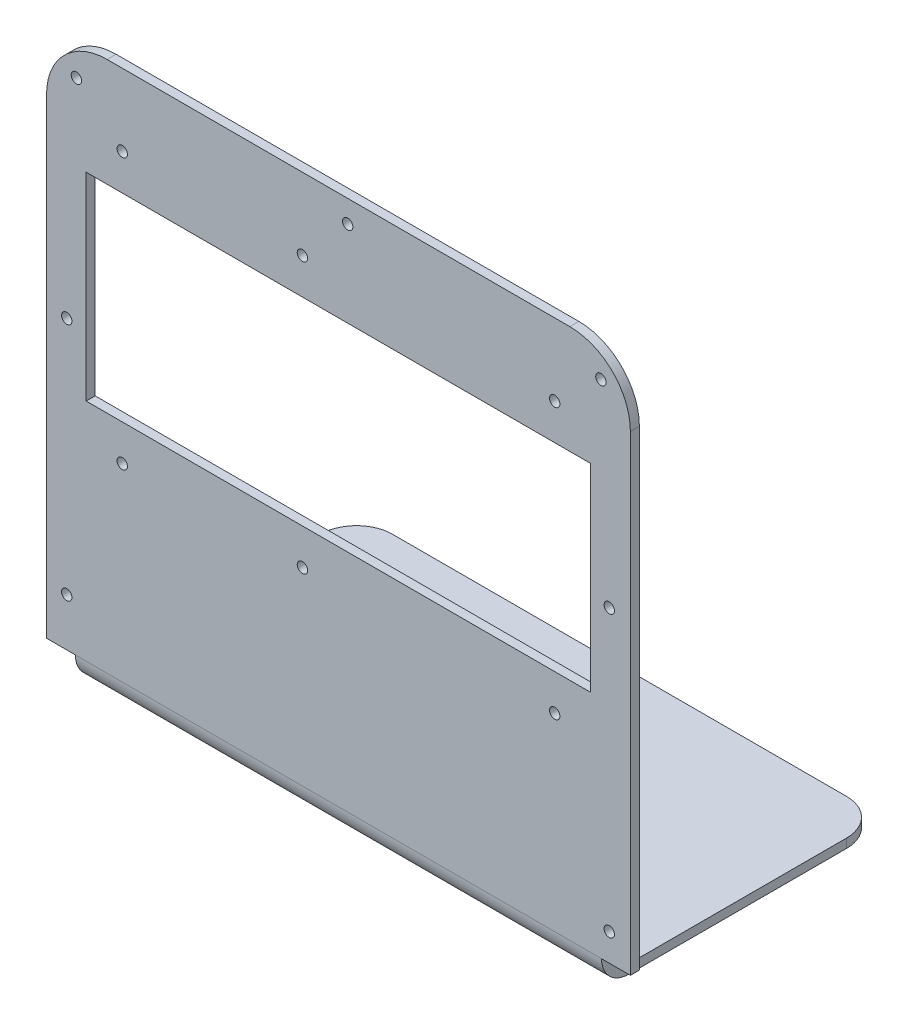
ISO-10303-21;
HEADER;
FILE_DESCRIPTION(('STEP AP214'),'2;1');
FILE_NAME('part.step','',(''),(''),'','','');
FILE_SCHEMA(('AUTOMOTIVE_DESIGN { 1 0 10303 214 1 1 1 1 }'));
ENDSEC;
DATA;
#1=APPLICATION_CONTEXT('core data for automotive mechanical design processes');
#2=APPLICATION_PROTOCOL_DEFINITION('international standard','automotive_design',2000,#1);
#3=PRODUCT_CONTEXT('',#1,'mechanical');
#4=PRODUCT('Part','Part','',(#3));
#5=PRODUCT_RELATED_PRODUCT_CATEGORY('part','',(#4));
#6=PRODUCT_DEFINITION_FORMATION('','',#4);
#7=PRODUCT_DEFINITION_CONTEXT('part definition',#1,'design');
#8=PRODUCT_DEFINITION('design','',#6,#7);
#9=PRODUCT_DEFINITION_SHAPE('','',#8);
#10=(LENGTH_UNIT() NAMED_UNIT(*) SI_UNIT(.MILLI.,.METRE.));
#11=(NAMED_UNIT(*) PLANE_ANGLE_UNIT() SI_UNIT($,.RADIAN.));
#12=(NAMED_UNIT(*) SI_UNIT($,.STERADIAN.) SOLID_ANGLE_UNIT());
#13=UNCERTAINTY_MEASURE_WITH_UNIT(LENGTH_MEASURE(1.E-05),#10,'distance_accuracy_value','');
#14=(GEOMETRIC_REPRESENTATION_CONTEXT(3) GLOBAL_UNCERTAINTY_ASSIGNED_CONTEXT((#13)) GLOBAL_UNIT_ASSIGNED_CONTEXT((#10,
#11,#12)) REPRESENTATION_CONTEXT('',''));
#15=CARTESIAN_POINT('',(0.,0.,0.));
#16=DIRECTION('',(0.,0.,1.));
#17=DIRECTION('',(1.,0.,0.));
#18=AXIS2_PLACEMENT_3D('',#15,#16,#17);
#19=CARTESIAN_POINT('',(-92.71,0.,0.));
#20=DIRECTION('',(1.,0.,0.));
#21=DIRECTION('',(0.,0.,1.));
#22=AXIS2_PLACEMENT_3D('',#19,#20,#21);
#23=PLANE('',#22);
#24=DIRECTION('',(0.,0.,-1.));
#25=VECTOR('',#24,1.);
#26=CARTESIAN_POINT('',(-92.71,-22.225,25.4));
#27=LINE('',#26,#25);
#28=CARTESIAN_POINT('',(-92.71,-22.225,15.875));
#29=VERTEX_POINT('',#28);
#30=CARTESIAN_POINT('',(-92.71,-22.225,-60.96));
#31=VERTEX_POINT('',#30);
#32=EDGE_CURVE('E220',#29,#31,#27,.T.);
#33=ORIENTED_EDGE('',*,*,#32,.T.);
#34=DIRECTION('',(0.,1.,0.));
#35=VECTOR('',#34,1.);
#36=CARTESIAN_POINT('',(-92.71,-25.4,-60.96));
#37=LINE('',#36,#35);
#38=CARTESIAN_POINT('',(-92.71,-25.4,-60.96));
#39=VERTEX_POINT('',#38);
#40=EDGE_CURVE('E309',#31,#39,#37,.F.);
#41=ORIENTED_EDGE('',*,*,#40,.T.);
#42=DIRECTION('',(0.,0.,-1.));
#43=VECTOR('',#42,1.);
#44=CARTESIAN_POINT('',(-92.71,-25.4,25.4));
#45=LINE('',#44,#43);
#46=CARTESIAN_POINT('',(-92.71,-25.4,15.875));
#47=VERTEX_POINT('',#46);
#48=EDGE_CURVE('E208',#47,#39,#45,.T.);
#49=ORIENTED_EDGE('',*,*,#48,.F.);
#50=DIRECTION('',(0.,1.,0.));
#51=VECTOR('',#50,1.);
#52=CARTESIAN_POINT('',(-92.71,-25.4,15.875));
#53=LINE('',#52,#51);
#54=EDGE_CURVE('E280',#47,#29,#53,.T.);
#55=ORIENTED_EDGE('',*,*,#54,.T.);
#56=EDGE_LOOP('',(#33,#41,#49,#55));
#57=FACE_BOUND('',#56,.T.);
#58=ADVANCED_FACE('F45',(#57),#23,.F.);
#59=CARTESIAN_POINT('',(92.71,0.,0.));
#60=DIRECTION('',(-1.,0.,0.));
#61=DIRECTION('',(0.,0.,1.));
#62=AXIS2_PLACEMENT_3D('',#59,#60,#61);
#63=PLANE('',#62);
#64=DIRECTION('',(0.,0.,-1.));
#65=VECTOR('',#64,1.);
#66=CARTESIAN_POINT('',(92.71,-25.4,25.4));
#67=LINE('',#66,#65);
#68=CARTESIAN_POINT('',(92.71,-25.4,15.875));
#69=VERTEX_POINT('',#68);
#70=CARTESIAN_POINT('',(92.71,-25.4,-60.96));
#71=VERTEX_POINT('',#70);
#72=EDGE_CURVE('E226',#69,#71,#67,.T.);
#73=ORIENTED_EDGE('',*,*,#72,.T.);
#74=DIRECTION('',(0.,1.,0.));
#75=VECTOR('',#74,1.);
#76=CARTESIAN_POINT('',(92.71,-22.225,-60.96));
#77=LINE('',#76,#75);
#78=CARTESIAN_POINT('',(92.71,-22.225,-60.96));
#79=VERTEX_POINT('',#78);
#80=EDGE_CURVE('E12',#71,#79,#77,.T.);
#81=ORIENTED_EDGE('',*,*,#80,.T.);
#82=DIRECTION('',(0.,0.,1.));
#83=VECTOR('',#82,1.);
#84=CARTESIAN_POINT('',(92.71,-22.225,25.4));
#85=LINE('',#84,#83);
#86=CARTESIAN_POINT('',(92.71,-22.225,15.875));
#87=VERTEX_POINT('',#86);
#88=EDGE_CURVE('E231',#79,#87,#85,.T.);
#89=ORIENTED_EDGE('',*,*,#88,.T.);
#90=DIRECTION('',(0.,-1.,0.));
#91=VECTOR('',#90,1.);
#92=CARTESIAN_POINT('',(92.71,-22.225,15.875));
#93=LINE('',#92,#91);
#94=EDGE_CURVE('E275',#87,#69,#93,.T.);
#95=ORIENTED_EDGE('',*,*,#94,.T.);
#96=EDGE_LOOP('',(#73,#81,#89,#95));
#97=FACE_BOUND('',#96,.T.);
#98=ADVANCED_FACE('F387',(#97),#63,.F.);
#99=CARTESIAN_POINT('',(102.87,-22.225,15.875));
#100=DIRECTION('',(1.,0.,0.));
#101=DIRECTION('',(0.,0.,-1.));
#102=AXIS2_PLACEMENT_3D('',#99,#100,#101);
#103=PLANE('',#102);
#104=DIRECTION('',(0.,1.,0.));
#105=VECTOR('',#104,1.);
#106=CARTESIAN_POINT('',(102.87,-25.4,22.225));
#107=LINE('',#106,#105);
#108=CARTESIAN_POINT('',(102.87,150.114,22.225));
#109=VERTEX_POINT('',#108);
#110=CARTESIAN_POINT('',(102.87,-15.875,22.225));
#111=VERTEX_POINT('',#110);
#112=EDGE_CURVE('E234',#109,#111,#107,.F.);
#113=ORIENTED_EDGE('',*,*,#112,.F.);
#114=DIRECTION('',(0.,0.,-1.));
#115=VECTOR('',#114,1.);
#116=CARTESIAN_POINT('',(102.87,150.114,15.875));
#117=LINE('',#116,#115);
#118=CARTESIAN_POINT('',(102.87,150.114,25.4));
#119=VERTEX_POINT('',#118);
#120=EDGE_CURVE('E298',#109,#119,#117,.F.);
#121=ORIENTED_EDGE('',*,*,#120,.T.);
#122=DIRECTION('',(0.,-1.,0.));
#123=VECTOR('',#122,1.);
#124=CARTESIAN_POINT('',(102.87,-25.4,25.4));
#125=LINE('',#124,#123);
#126=CARTESIAN_POINT('',(102.87,-15.875,25.4));
#127=VERTEX_POINT('',#126);
#128=EDGE_CURVE('E236',#119,#127,#125,.T.);
#129=ORIENTED_EDGE('',*,*,#128,.T.);
#130=DIRECTION('',(0.,0.,-1.));
#131=VECTOR('',#130,1.);
#132=CARTESIAN_POINT('',(102.87,-15.875,25.4));
#133=LINE('',#132,#131);
#134=EDGE_CURVE('E269',#127,#111,#133,.T.);
#135=ORIENTED_EDGE('',*,*,#134,.T.);
#136=EDGE_LOOP('',(#113,#121,#129,#135));
#137=FACE_BOUND('',#136,.T.);
#138=ADVANCED_FACE('F351',(#137),#103,.T.);
#139=CARTESIAN_POINT('',(102.87,-25.4,25.4));
#140=DIRECTION('',(0.,1.,0.));
#141=DIRECTION('',(0.,0.,1.));
#142=AXIS2_PLACEMENT_3D('',#139,#140,#141);
#143=PLANE('',#142);
#144=ORIENTED_EDGE('',*,*,#48,.T.);
#145=CARTESIAN_POINT('',(-80.01,-25.4,-60.96));
#146=DIRECTION('',(0.,1.,0.));
#147=DIRECTION('',(0.,0.,1.));
#148=AXIS2_PLACEMENT_3D('',#145,#146,#147);
#149=CIRCLE('',#148,12.7);
#150=CARTESIAN_POINT('',(-80.01,-25.4,-73.66));
#151=VERTEX_POINT('',#150);
#152=EDGE_CURVE('E53',#39,#151,#149,.F.);
#153=ORIENTED_EDGE('',*,*,#152,.T.);
#154=DIRECTION('',(-1.,0.,0.));
#155=VECTOR('',#154,1.);
#156=CARTESIAN_POINT('',(102.87,-25.4,-73.66));
#157=LINE('',#156,#155);
#158=CARTESIAN_POINT('',(80.01,-25.4,-73.66));
#159=VERTEX_POINT('',#158);
#160=EDGE_CURVE('E263',#159,#151,#157,.T.);
#161=ORIENTED_EDGE('',*,*,#160,.F.);
#162=CARTESIAN_POINT('',(80.01,-25.4,-60.96));
#163=DIRECTION('',(0.,1.,0.));
#164=DIRECTION('',(0.,0.,1.));
#165=AXIS2_PLACEMENT_3D('',#162,#163,#164);
#166=CIRCLE('',#165,12.7);
#167=EDGE_CURVE('E311',#159,#71,#166,.F.);
#168=ORIENTED_EDGE('',*,*,#167,.T.);
#169=ORIENTED_EDGE('',*,*,#72,.F.);
#170=DIRECTION('',(-1.,0.,0.));
#171=VECTOR('',#170,1.);
#172=CARTESIAN_POINT('',(102.87,-25.4,15.875));
#173=LINE('',#172,#171);
#174=EDGE_CURVE('E239',#69,#47,#173,.T.);
#175=ORIENTED_EDGE('',*,*,#174,.T.);
#176=EDGE_LOOP('',(#144,#153,#161,#168,#169,#175));
#177=FACE_BOUND('',#176,.T.);
#178=ADVANCED_FACE('F315',(#177),#143,.F.);
#179=CARTESIAN_POINT('',(102.87,-22.225,-73.66));
#180=DIRECTION('',(0.,0.,-1.));
#181=DIRECTION('',(-1.,0.,0.));
#182=AXIS2_PLACEMENT_3D('',#179,#180,#181);
#183=PLANE('',#182);
#184=ORIENTED_EDGE('',*,*,#160,.T.);
#185=DIRECTION('',(0.,1.,0.));
#186=VECTOR('',#185,1.);
#187=CARTESIAN_POINT('',(-80.01,-22.225,-73.66));
#188=LINE('',#187,#186);
#189=CARTESIAN_POINT('',(-80.01,-22.225,-73.66));
#190=VERTEX_POINT('',#189);
#191=EDGE_CURVE('E302',#151,#190,#188,.T.);
#192=ORIENTED_EDGE('',*,*,#191,.T.);
#193=DIRECTION('',(-1.,0.,0.));
#194=VECTOR('',#193,1.);
#195=CARTESIAN_POINT('',(102.87,-22.225,-73.66));
#196=LINE('',#195,#194);
#197=CARTESIAN_POINT('',(80.01,-22.225,-73.66));
#198=VERTEX_POINT('',#197);
#199=EDGE_CURVE('E260',#198,#190,#196,.T.);
#200=ORIENTED_EDGE('',*,*,#199,.F.);
#201=DIRECTION('',(0.,1.,0.));
#202=VECTOR('',#201,1.);
#203=CARTESIAN_POINT('',(80.01,-25.4,-73.66));
#204=LINE('',#203,#202);
#205=EDGE_CURVE('E300',#198,#159,#204,.F.);
#206=ORIENTED_EDGE('',*,*,#205,.T.);
#207=EDGE_LOOP('',(#184,#192,#200,#206));
#208=FACE_BOUND('',#207,.T.);
#209=ADVANCED_FACE('F322',(#208),#183,.T.);
#210=CARTESIAN_POINT('',(102.87,-22.225,25.4));
#211=DIRECTION('',(0.,1.,0.));
#212=DIRECTION('',(0.,0.,1.));
#213=AXIS2_PLACEMENT_3D('',#210,#211,#212);
#214=PLANE('',#213);
#215=ORIENTED_EDGE('',*,*,#199,.T.);
#216=CARTESIAN_POINT('',(-80.01,-22.225,-60.96));
#217=DIRECTION('',(0.,1.,0.));
#218=DIRECTION('',(0.,0.,1.));
#219=AXIS2_PLACEMENT_3D('',#216,#217,#218);
#220=CIRCLE('',#219,12.7);
#221=EDGE_CURVE('E307',#190,#31,#220,.T.);
#222=ORIENTED_EDGE('',*,*,#221,.T.);
#223=ORIENTED_EDGE('',*,*,#32,.F.);
#224=DIRECTION('',(-1.,0.,0.));
#225=VECTOR('',#224,1.);
#226=CARTESIAN_POINT('',(102.87,-22.225,15.875));
#227=LINE('',#226,#225);
#228=EDGE_CURVE('E257',#87,#29,#227,.T.);
#229=ORIENTED_EDGE('',*,*,#228,.F.);
#230=ORIENTED_EDGE('',*,*,#88,.F.);
#231=CARTESIAN_POINT('',(80.01,-22.225,-60.96));
#232=DIRECTION('',(0.,1.,0.));
#233=DIRECTION('',(0.,0.,1.));
#234=AXIS2_PLACEMENT_3D('',#231,#232,#233);
#235=CIRCLE('',#234,12.7);
#236=EDGE_CURVE('E305',#79,#198,#235,.T.);
#237=ORIENTED_EDGE('',*,*,#236,.T.);
#238=EDGE_LOOP('',(#215,#222,#223,#229,#230,#237));
#239=FACE_BOUND('',#238,.T.);
#240=ADVANCED_FACE('F328',(#239),#214,.T.);
#241=CARTESIAN_POINT('',(102.87,-15.875,15.875));
#242=DIRECTION('',(-1.,0.,0.));
#243=DIRECTION('',(0.,0.,1.));
#244=AXIS2_PLACEMENT_3D('',#241,#242,#243);
#245=CYLINDRICAL_SURFACE('',#244,6.35);
#246=CARTESIAN_POINT('',(-92.71,-15.875,15.875));
#247=DIRECTION('',(1.,0.,0.));
#248=DIRECTION('',(0.,0.,-1.));
#249=AXIS2_PLACEMENT_3D('',#246,#247,#248);
#250=CIRCLE('',#249,6.35);
#251=CARTESIAN_POINT('',(-92.71,-15.875,22.225));
#252=VERTEX_POINT('',#251);
#253=EDGE_CURVE('E217',#252,#29,#250,.T.);
#254=ORIENTED_EDGE('',*,*,#253,.F.);
#255=DIRECTION('',(-1.,0.,0.));
#256=VECTOR('',#255,1.);
#257=CARTESIAN_POINT('',(102.87,-15.875,22.225));
#258=LINE('',#257,#256);
#259=CARTESIAN_POINT('',(92.71,-15.875,22.225));
#260=VERTEX_POINT('',#259);
#261=EDGE_CURVE('E253',#260,#252,#258,.T.);
#262=ORIENTED_EDGE('',*,*,#261,.F.);
#263=CARTESIAN_POINT('',(92.71,-15.875,15.875));
#264=DIRECTION('',(-1.,0.,0.));
#265=DIRECTION('',(0.,0.,1.));
#266=AXIS2_PLACEMENT_3D('',#263,#264,#265);
#267=CIRCLE('',#266,6.35);
#268=EDGE_CURVE('E229',#87,#260,#267,.T.);
#269=ORIENTED_EDGE('',*,*,#268,.F.);
#270=ORIENTED_EDGE('',*,*,#228,.T.);
#271=EDGE_LOOP('',(#254,#262,#269,#270));
#272=FACE_BOUND('',#271,.T.);
#273=ADVANCED_FACE('F338',(#272),#245,.F.);
#274=CARTESIAN_POINT('',(102.87,-25.4,22.225));
#275=DIRECTION('',(0.,0.,-1.));
#276=DIRECTION('',(-1.,0.,0.));
#277=AXIS2_PLACEMENT_3D('',#274,#275,#276);
#278=PLANE('',#277);
#279=CARTESIAN_POINT('',(92.4814,160.8074,22.225));
#280=DIRECTION('',(0.,0.,-1.));
#281=DIRECTION('',(-1.,0.,0.));
#282=AXIS2_PLACEMENT_3D('',#279,#280,#281);
#283=CIRCLE('',#282,1.82879999999999);
#284=CARTESIAN_POINT('',(90.6526,160.8074,22.225));
#285=VERTEX_POINT('',#284);
#286=EDGE_CURVE('E462',#285,#285,#283,.T.);
#287=ORIENTED_EDGE('',*,*,#286,.F.);
#288=EDGE_LOOP('',(#287));
#289=FACE_BOUND('',#288,.T.);
#290=CARTESIAN_POINT('',(95.4278,92.583,22.225));
#291=DIRECTION('',(0.,0.,-1.));
#292=DIRECTION('',(-1.,0.,0.));
#293=AXIS2_PLACEMENT_3D('',#290,#291,#292);
#294=CIRCLE('',#293,1.82879999999999);
#295=CARTESIAN_POINT('',(93.599,92.583,22.225));
#296=VERTEX_POINT('',#295);
#297=EDGE_CURVE('E473',#296,#296,#294,.T.);
#298=ORIENTED_EDGE('',*,*,#297,.F.);
#299=EDGE_LOOP('',(#298));
#300=FACE_BOUND('',#299,.T.);
#301=CARTESIAN_POINT('',(95.4278,-6.22300000000001,22.225));
#302=DIRECTION('',(0.,0.,-1.));
#303=DIRECTION('',(-1.,0.,0.));
#304=AXIS2_PLACEMENT_3D('',#301,#302,#303);
#305=CIRCLE('',#304,1.82879999999999);
#306=CARTESIAN_POINT('',(93.599,-6.22300000000001,22.225));
#307=VERTEX_POINT('',#306);
#308=EDGE_CURVE('E479',#307,#307,#305,.T.);
#309=ORIENTED_EDGE('',*,*,#308,.F.);
#310=EDGE_LOOP('',(#309));
#311=FACE_BOUND('',#310,.T.);
#312=CARTESIAN_POINT('',(-95.758,1.01599999999999,22.225));
#313=DIRECTION('',(0.,0.,-1.));
#314=DIRECTION('',(-1.,0.,0.));
#315=AXIS2_PLACEMENT_3D('',#312,#313,#314);
#316=CIRCLE('',#315,1.82879999999999);
#317=CARTESIAN_POINT('',(-97.5868,1.01599999999999,22.225));
#318=VERTEX_POINT('',#317);
#319=EDGE_CURVE('E485',#318,#318,#316,.T.);
#320=ORIENTED_EDGE('',*,*,#319,.F.);
#321=EDGE_LOOP('',(#320));
#322=FACE_BOUND('',#321,.T.);
#323=CARTESIAN_POINT('',(-95.758,85.344,22.225));
#324=DIRECTION('',(0.,0.,-1.));
#325=DIRECTION('',(-1.,0.,0.));
#326=AXIS2_PLACEMENT_3D('',#323,#324,#325);
#327=CIRCLE('',#326,1.82879999999999);
#328=CARTESIAN_POINT('',(-97.5868,85.344,22.225));
#329=VERTEX_POINT('',#328);
#330=EDGE_CURVE('E491',#329,#329,#327,.T.);
#331=ORIENTED_EDGE('',*,*,#330,.F.);
#332=EDGE_LOOP('',(#331));
#333=FACE_BOUND('',#332,.T.);
#334=CARTESIAN_POINT('',(-92.3544,160.401,22.225));
#335=DIRECTION('',(0.,0.,-1.));
#336=DIRECTION('',(-1.,0.,0.));
#337=AXIS2_PLACEMENT_3D('',#334,#335,#336);
#338=CIRCLE('',#337,1.82879999999999);
#339=CARTESIAN_POINT('',(-94.1832,160.401,22.225));
#340=VERTEX_POINT('',#339);
#341=EDGE_CURVE('E497',#340,#340,#338,.T.);
#342=ORIENTED_EDGE('',*,*,#341,.F.);
#343=EDGE_LOOP('',(#342));
#344=FACE_BOUND('',#343,.T.);
#345=CARTESIAN_POINT('',(3.25120000000001,163.6268,22.225));
#346=DIRECTION('',(0.,0.,-1.));
#347=DIRECTION('',(-1.,0.,0.));
#348=AXIS2_PLACEMENT_3D('',#345,#346,#347);
#349=CIRCLE('',#348,1.82879999999999);
#350=CARTESIAN_POINT('',(1.42240000000002,163.6268,22.225));
#351=VERTEX_POINT('',#350);
#352=EDGE_CURVE('E503',#351,#351,#349,.T.);
#353=ORIENTED_EDGE('',*,*,#352,.F.);
#354=EDGE_LOOP('',(#353));
#355=FACE_BOUND('',#354,.T.);
#356=CARTESIAN_POINT('',(-76.2,146.05,22.225));
#357=DIRECTION('',(0.,0.,-1.));
#358=DIRECTION('',(-1.,0.,0.));
#359=AXIS2_PLACEMENT_3D('',#356,#357,#358);
#360=CIRCLE('',#359,1.82879999999998);
#361=CARTESIAN_POINT('',(-78.0288,146.05,22.225));
#362=VERTEX_POINT('',#361);
#363=EDGE_CURVE('E509',#362,#362,#360,.T.);
#364=ORIENTED_EDGE('',*,*,#363,.F.);
#365=EDGE_LOOP('',(#364));
#366=FACE_BOUND('',#365,.T.);
#367=CARTESIAN_POINT('',(-12.7,146.05,22.225));
#368=DIRECTION('',(0.,0.,-1.));
#369=DIRECTION('',(-1.,0.,0.));
#370=AXIS2_PLACEMENT_3D('',#367,#368,#369);
#371=CIRCLE('',#370,1.82879999999998);
#372=CARTESIAN_POINT('',(-14.5288,146.05,22.225));
#373=VERTEX_POINT('',#372);
#374=EDGE_CURVE('E515',#373,#373,#371,.T.);
#375=ORIENTED_EDGE('',*,*,#374,.F.);
#376=EDGE_LOOP('',(#375));
#377=FACE_BOUND('',#376,.T.);
#378=CARTESIAN_POINT('',(76.2,146.05,22.225));
#379=DIRECTION('',(0.,0.,-1.));
#380=DIRECTION('',(-1.,0.,0.));
#381=AXIS2_PLACEMENT_3D('',#378,#379,#380);
#382=CIRCLE('',#381,1.82879999999998);
#383=CARTESIAN_POINT('',(74.3712,146.05,22.225));
#384=VERTEX_POINT('',#383);
#385=EDGE_CURVE('E521',#384,#384,#382,.T.);
#386=ORIENTED_EDGE('',*,*,#385,.F.);
#387=EDGE_LOOP('',(#386));
#388=FACE_BOUND('',#387,.T.);
#389=CARTESIAN_POINT('',(76.2,50.8,22.225));
#390=DIRECTION('',(0.,0.,-1.));
#391=DIRECTION('',(-1.,0.,0.));
#392=AXIS2_PLACEMENT_3D('',#389,#390,#391);
#393=CIRCLE('',#392,1.82879999999998);
#394=CARTESIAN_POINT('',(74.3712,50.8,22.225));
#395=VERTEX_POINT('',#394);
#396=EDGE_CURVE('E527',#395,#395,#393,.T.);
#397=ORIENTED_EDGE('',*,*,#396,.F.);
#398=EDGE_LOOP('',(#397));
#399=FACE_BOUND('',#398,.T.);
#400=CARTESIAN_POINT('',(-12.7,50.8,22.225));
#401=DIRECTION('',(0.,0.,-1.));
#402=DIRECTION('',(-1.,0.,0.));
#403=AXIS2_PLACEMENT_3D('',#400,#401,#402);
#404=CIRCLE('',#403,1.82879999999998);
#405=CARTESIAN_POINT('',(-14.5288,50.8,22.225));
#406=VERTEX_POINT('',#405);
#407=EDGE_CURVE('E533',#406,#406,#404,.T.);
#408=ORIENTED_EDGE('',*,*,#407,.F.);
#409=EDGE_LOOP('',(#408));
#410=FACE_BOUND('',#409,.T.);
#411=CARTESIAN_POINT('',(-76.2,50.8,22.225));
#412=DIRECTION('',(0.,0.,-1.));
#413=DIRECTION('',(-1.,0.,0.));
#414=AXIS2_PLACEMENT_3D('',#411,#412,#413);
#415=CIRCLE('',#414,1.82879999999998);
#416=CARTESIAN_POINT('',(-78.0288,50.8,22.225));
#417=VERTEX_POINT('',#416);
#418=EDGE_CURVE('E539',#417,#417,#415,.T.);
#419=ORIENTED_EDGE('',*,*,#418,.F.);
#420=EDGE_LOOP('',(#419));
#421=FACE_BOUND('',#420,.T.);
#422=DIRECTION('',(0.,-1.,0.));
#423=VECTOR('',#422,1.);
#424=CARTESIAN_POINT('',(88.9,-25.4,22.225));
#425=LINE('',#424,#423);
#426=CARTESIAN_POINT('',(88.9,133.35,22.225));
#427=VERTEX_POINT('',#426);
#428=CARTESIAN_POINT('',(88.9,63.5,22.225));
#429=VERTEX_POINT('',#428);
#430=EDGE_CURVE('E203',#427,#429,#425,.T.);
#431=ORIENTED_EDGE('',*,*,#430,.F.);
#432=DIRECTION('',(1.,0.,0.));
#433=VECTOR('',#432,1.);
#434=CARTESIAN_POINT('',(102.87,133.35,22.225));
#435=LINE('',#434,#433);
#436=CARTESIAN_POINT('',(-88.9,133.35,22.225));
#437=VERTEX_POINT('',#436);
#438=EDGE_CURVE('E196',#437,#427,#435,.T.);
#439=ORIENTED_EDGE('',*,*,#438,.F.);
#440=DIRECTION('',(0.,1.,0.));
#441=VECTOR('',#440,1.);
#442=CARTESIAN_POINT('',(-88.9,-25.4,22.225));
#443=LINE('',#442,#441);
#444=CARTESIAN_POINT('',(-88.9,63.5,22.225));
#445=VERTEX_POINT('',#444);
#446=EDGE_CURVE('E176',#445,#437,#443,.T.);
#447=ORIENTED_EDGE('',*,*,#446,.F.);
#448=DIRECTION('',(-1.,0.,0.));
#449=VECTOR('',#448,1.);
#450=CARTESIAN_POINT('',(102.87,63.5,22.225));
#451=LINE('',#450,#449);
#452=EDGE_CURVE('E201',#429,#445,#451,.T.);
#453=ORIENTED_EDGE('',*,*,#452,.F.);
#454=EDGE_LOOP('',(#431,#439,#447,#453));
#455=FACE_BOUND('',#454,.T.);
#456=DIRECTION('',(0.,1.,0.));
#457=VECTOR('',#456,1.);
#458=CARTESIAN_POINT('',(-102.87,-25.4,22.225));
#459=LINE('',#458,#457);
#460=CARTESIAN_POINT('',(-102.87,150.114,22.225));
#461=VERTEX_POINT('',#460);
#462=CARTESIAN_POINT('',(-102.87,-15.875,22.225));
#463=VERTEX_POINT('',#462);
#464=EDGE_CURVE('E233',#461,#463,#459,.F.);
#465=ORIENTED_EDGE('',*,*,#464,.F.);
#466=CARTESIAN_POINT('',(-81.534,150.114,22.225));
#467=DIRECTION('',(0.,0.,-1.));
#468=DIRECTION('',(-1.,0.,0.));
#469=AXIS2_PLACEMENT_3D('',#466,#467,#468);
#470=CIRCLE('',#469,21.336);
#471=CARTESIAN_POINT('',(-81.534,171.45,22.225));
#472=VERTEX_POINT('',#471);
#473=EDGE_CURVE('E287',#461,#472,#470,.T.);
#474=ORIENTED_EDGE('',*,*,#473,.T.);
#475=DIRECTION('',(-1.,0.,0.));
#476=VECTOR('',#475,1.);
#477=CARTESIAN_POINT('',(102.87,171.45,22.225));
#478=LINE('',#477,#476);
#479=CARTESIAN_POINT('',(81.534,171.45,22.225));
#480=VERTEX_POINT('',#479);
#481=EDGE_CURVE('E250',#480,#472,#478,.T.);
#482=ORIENTED_EDGE('',*,*,#481,.F.);
#483=CARTESIAN_POINT('',(81.534,150.114,22.225));
#484=DIRECTION('',(0.,0.,-1.));
#485=DIRECTION('',(-1.,0.,0.));
#486=AXIS2_PLACEMENT_3D('',#483,#484,#485);
#487=CIRCLE('',#486,21.336);
#488=EDGE_CURVE('E285',#480,#109,#487,.T.);
#489=ORIENTED_EDGE('',*,*,#488,.T.);
#490=ORIENTED_EDGE('',*,*,#112,.T.);
#491=EDGE_CURVE('E254',#111,#260,#258,.T.);
#492=ORIENTED_EDGE('',*,*,#491,.T.);
#493=ORIENTED_EDGE('',*,*,#261,.T.);
#494=DIRECTION('',(-1.,0.,0.));
#495=VECTOR('',#494,1.);
#496=CARTESIAN_POINT('',(102.87,-15.875,22.225));
#497=LINE('',#496,#495);
#498=EDGE_CURVE('E214',#252,#463,#497,.T.);
#499=ORIENTED_EDGE('',*,*,#498,.T.);
#500=EDGE_LOOP('',(#465,#474,#482,#489,#490,#492,#493,#499));
#501=FACE_BOUND('',#500,.T.);
#502=ADVANCED_FACE('F342',(#289,#300,#311,#322,#333,#344,#355,#366,#377,#388,#399,#410,#421,
#455,#501),#278,.T.);
#503=CARTESIAN_POINT('',(102.87,171.45,25.4));
#504=DIRECTION('',(0.,1.,0.));
#505=DIRECTION('',(0.,0.,1.));
#506=AXIS2_PLACEMENT_3D('',#503,#504,#505);
#507=PLANE('',#506);
#508=ORIENTED_EDGE('',*,*,#481,.T.);
#509=DIRECTION('',(0.,0.,-1.));
#510=VECTOR('',#509,1.);
#511=CARTESIAN_POINT('',(-81.534,171.45,25.4));
#512=LINE('',#511,#510);
#513=CARTESIAN_POINT('',(-81.534,171.45,25.4));
#514=VERTEX_POINT('',#513);
#515=EDGE_CURVE('E292',#472,#514,#512,.F.);
#516=ORIENTED_EDGE('',*,*,#515,.T.);
#517=DIRECTION('',(-1.,0.,0.));
#518=VECTOR('',#517,1.);
#519=CARTESIAN_POINT('',(102.87,171.45,25.4));
#520=LINE('',#519,#518);
#521=CARTESIAN_POINT('',(81.534,171.45,25.4));
#522=VERTEX_POINT('',#521);
#523=EDGE_CURVE('E247',#522,#514,#520,.T.);
#524=ORIENTED_EDGE('',*,*,#523,.F.);
#525=DIRECTION('',(0.,0.,-1.));
#526=VECTOR('',#525,1.);
#527=CARTESIAN_POINT('',(81.534,171.45,25.4));
#528=LINE('',#527,#526);
#529=EDGE_CURVE('E289',#522,#480,#528,.T.);
#530=ORIENTED_EDGE('',*,*,#529,.T.);
#531=EDGE_LOOP('',(#508,#516,#524,#530));
#532=FACE_BOUND('',#531,.T.);
#533=ADVANCED_FACE('F362',(#532),#507,.T.);
#534=CARTESIAN_POINT('',(102.87,-25.4,25.4));
#535=DIRECTION('',(0.,0.,-1.));
#536=DIRECTION('',(-1.,0.,0.));
#537=AXIS2_PLACEMENT_3D('',#534,#535,#536);
#538=PLANE('',#537);
#539=CARTESIAN_POINT('',(92.4814,160.8074,25.4));
#540=DIRECTION('',(0.,0.,1.));
#541=DIRECTION('',(1.,0.,0.));
#542=AXIS2_PLACEMENT_3D('',#539,#540,#541);
#543=CIRCLE('',#542,1.82879999999999);
#544=CARTESIAN_POINT('',(94.3102,160.8074,25.4));
#545=VERTEX_POINT('',#544);
#546=EDGE_CURVE('E465',#545,#545,#543,.T.);
#547=ORIENTED_EDGE('',*,*,#546,.F.);
#548=EDGE_LOOP('',(#547));
#549=FACE_BOUND('',#548,.T.);
#550=CARTESIAN_POINT('',(95.4278,92.583,25.4));
#551=DIRECTION('',(0.,0.,1.));
#552=DIRECTION('',(1.,0.,0.));
#553=AXIS2_PLACEMENT_3D('',#550,#551,#552);
#554=CIRCLE('',#553,1.82879999999999);
#555=CARTESIAN_POINT('',(97.2566,92.583,25.4));
#556=VERTEX_POINT('',#555);
#557=EDGE_CURVE('E468',#556,#556,#554,.T.);
#558=ORIENTED_EDGE('',*,*,#557,.F.);
#559=EDGE_LOOP('',(#558));
#560=FACE_BOUND('',#559,.T.);
#561=CARTESIAN_POINT('',(95.4278,-6.22300000000001,25.4));
#562=DIRECTION('',(0.,0.,1.));
#563=DIRECTION('',(1.,0.,0.));
#564=AXIS2_PLACEMENT_3D('',#561,#562,#563);
#565=CIRCLE('',#564,1.82879999999999);
#566=CARTESIAN_POINT('',(97.2566,-6.22300000000001,25.4));
#567=VERTEX_POINT('',#566);
#568=EDGE_CURVE('E476',#567,#567,#565,.T.);
#569=ORIENTED_EDGE('',*,*,#568,.F.);
#570=EDGE_LOOP('',(#569));
#571=FACE_BOUND('',#570,.T.);
#572=CARTESIAN_POINT('',(-95.758,1.01599999999999,25.4));
#573=DIRECTION('',(0.,0.,1.));
#574=DIRECTION('',(1.,0.,0.));
#575=AXIS2_PLACEMENT_3D('',#572,#573,#574);
#576=CIRCLE('',#575,1.82879999999999);
#577=CARTESIAN_POINT('',(-93.9292,1.01599999999999,25.4));
#578=VERTEX_POINT('',#577);
#579=EDGE_CURVE('E482',#578,#578,#576,.T.);
#580=ORIENTED_EDGE('',*,*,#579,.F.);
#581=EDGE_LOOP('',(#580));
#582=FACE_BOUND('',#581,.T.);
#583=CARTESIAN_POINT('',(-95.758,85.344,25.4));
#584=DIRECTION('',(0.,0.,1.));
#585=DIRECTION('',(1.,0.,0.));
#586=AXIS2_PLACEMENT_3D('',#583,#584,#585);
#587=CIRCLE('',#586,1.82879999999999);
#588=CARTESIAN_POINT('',(-93.9292,85.344,25.4));
#589=VERTEX_POINT('',#588);
#590=EDGE_CURVE('E488',#589,#589,#587,.T.);
#591=ORIENTED_EDGE('',*,*,#590,.F.);
#592=EDGE_LOOP('',(#591));
#593=FACE_BOUND('',#592,.T.);
#594=CARTESIAN_POINT('',(-92.3544,160.401,25.4));
#595=DIRECTION('',(0.,0.,1.));
#596=DIRECTION('',(1.,0.,0.));
#597=AXIS2_PLACEMENT_3D('',#594,#595,#596);
#598=CIRCLE('',#597,1.82879999999999);
#599=CARTESIAN_POINT('',(-90.5256,160.401,25.4));
#600=VERTEX_POINT('',#599);
#601=EDGE_CURVE('E494',#600,#600,#598,.T.);
#602=ORIENTED_EDGE('',*,*,#601,.F.);
#603=EDGE_LOOP('',(#602));
#604=FACE_BOUND('',#603,.T.);
#605=CARTESIAN_POINT('',(3.25120000000001,163.6268,25.4));
#606=DIRECTION('',(0.,0.,1.));
#607=DIRECTION('',(1.,0.,0.));
#608=AXIS2_PLACEMENT_3D('',#605,#606,#607);
#609=CIRCLE('',#608,1.82879999999999);
#610=CARTESIAN_POINT('',(5.08,163.6268,25.4));
#611=VERTEX_POINT('',#610);
#612=EDGE_CURVE('E500',#611,#611,#609,.T.);
#613=ORIENTED_EDGE('',*,*,#612,.F.);
#614=EDGE_LOOP('',(#613));
#615=FACE_BOUND('',#614,.T.);
#616=CARTESIAN_POINT('',(-76.2,146.05,25.4));
#617=DIRECTION('',(0.,0.,1.));
#618=DIRECTION('',(1.,0.,0.));
#619=AXIS2_PLACEMENT_3D('',#616,#617,#618);
#620=CIRCLE('',#619,1.82879999999999);
#621=CARTESIAN_POINT('',(-74.3712,146.05,25.4));
#622=VERTEX_POINT('',#621);
#623=EDGE_CURVE('E506',#622,#622,#620,.T.);
#624=ORIENTED_EDGE('',*,*,#623,.F.);
#625=EDGE_LOOP('',(#624));
#626=FACE_BOUND('',#625,.T.);
#627=CARTESIAN_POINT('',(-12.7,146.05,25.4));
#628=DIRECTION('',(0.,0.,1.));
#629=DIRECTION('',(1.,0.,0.));
#630=AXIS2_PLACEMENT_3D('',#627,#628,#629);
#631=CIRCLE('',#630,1.82879999999999);
#632=CARTESIAN_POINT('',(-10.8712,146.05,25.4));
#633=VERTEX_POINT('',#632);
#634=EDGE_CURVE('E512',#633,#633,#631,.T.);
#635=ORIENTED_EDGE('',*,*,#634,.F.);
#636=EDGE_LOOP('',(#635));
#637=FACE_BOUND('',#636,.T.);
#638=CARTESIAN_POINT('',(76.2,146.05,25.4));
#639=DIRECTION('',(0.,0.,1.));
#640=DIRECTION('',(1.,0.,0.));
#641=AXIS2_PLACEMENT_3D('',#638,#639,#640);
#642=CIRCLE('',#641,1.82879999999999);
#643=CARTESIAN_POINT('',(78.0287999999999,146.05,25.4));
#644=VERTEX_POINT('',#643);
#645=EDGE_CURVE('E518',#644,#644,#642,.T.);
#646=ORIENTED_EDGE('',*,*,#645,.F.);
#647=EDGE_LOOP('',(#646));
#648=FACE_BOUND('',#647,.T.);
#649=CARTESIAN_POINT('',(76.2,50.8,25.4));
#650=DIRECTION('',(0.,0.,1.));
#651=DIRECTION('',(1.,0.,0.));
#652=AXIS2_PLACEMENT_3D('',#649,#650,#651);
#653=CIRCLE('',#652,1.82879999999999);
#654=CARTESIAN_POINT('',(78.0287999999999,50.8,25.4));
#655=VERTEX_POINT('',#654);
#656=EDGE_CURVE('E524',#655,#655,#653,.T.);
#657=ORIENTED_EDGE('',*,*,#656,.F.);
#658=EDGE_LOOP('',(#657));
#659=FACE_BOUND('',#658,.T.);
#660=CARTESIAN_POINT('',(-12.7,50.8,25.4));
#661=DIRECTION('',(0.,0.,1.));
#662=DIRECTION('',(1.,0.,0.));
#663=AXIS2_PLACEMENT_3D('',#660,#661,#662);
#664=CIRCLE('',#663,1.82879999999999);
#665=CARTESIAN_POINT('',(-10.8712,50.8,25.4));
#666=VERTEX_POINT('',#665);
#667=EDGE_CURVE('E530',#666,#666,#664,.T.);
#668=ORIENTED_EDGE('',*,*,#667,.F.);
#669=EDGE_LOOP('',(#668));
#670=FACE_BOUND('',#669,.T.);
#671=CARTESIAN_POINT('',(-76.2,50.8,25.4));
#672=DIRECTION('',(0.,0.,1.));
#673=DIRECTION('',(1.,0.,0.));
#674=AXIS2_PLACEMENT_3D('',#671,#672,#673);
#675=CIRCLE('',#674,1.82879999999999);
#676=CARTESIAN_POINT('',(-74.3712,50.8,25.4));
#677=VERTEX_POINT('',#676);
#678=EDGE_CURVE('E536',#677,#677,#675,.T.);
#679=ORIENTED_EDGE('',*,*,#678,.F.);
#680=EDGE_LOOP('',(#679));
#681=FACE_BOUND('',#680,.T.);
#682=DIRECTION('',(-1.,0.,0.));
#683=VECTOR('',#682,1.);
#684=CARTESIAN_POINT('',(-88.9,133.35,25.4));
#685=LINE('',#684,#683);
#686=CARTESIAN_POINT('',(88.9,133.35,25.4));
#687=VERTEX_POINT('',#686);
#688=CARTESIAN_POINT('',(-88.9,133.35,25.4));
#689=VERTEX_POINT('',#688);
#690=EDGE_CURVE('E182',#687,#689,#685,.T.);
#691=ORIENTED_EDGE('',*,*,#690,.F.);
#692=DIRECTION('',(0.,1.,0.));
#693=VECTOR('',#692,1.);
#694=CARTESIAN_POINT('',(88.9,63.5,25.4));
#695=LINE('',#694,#693);
#696=CARTESIAN_POINT('',(88.9,63.5,25.4));
#697=VERTEX_POINT('',#696);
#698=EDGE_CURVE('E68',#697,#687,#695,.T.);
#699=ORIENTED_EDGE('',*,*,#698,.F.);
#700=DIRECTION('',(1.,0.,0.));
#701=VECTOR('',#700,1.);
#702=CARTESIAN_POINT('',(-88.9,63.5,25.4));
#703=LINE('',#702,#701);
#704=CARTESIAN_POINT('',(-88.9,63.5,25.4));
#705=VERTEX_POINT('',#704);
#706=EDGE_CURVE('E189',#705,#697,#703,.T.);
#707=ORIENTED_EDGE('',*,*,#706,.F.);
#708=DIRECTION('',(0.,-1.,0.));
#709=VECTOR('',#708,1.);
#710=CARTESIAN_POINT('',(-88.9,63.5,25.4));
#711=LINE('',#710,#709);
#712=EDGE_CURVE('E173',#689,#705,#711,.T.);
#713=ORIENTED_EDGE('',*,*,#712,.F.);
#714=EDGE_LOOP('',(#691,#699,#707,#713));
#715=FACE_BOUND('',#714,.T.);
#716=ORIENTED_EDGE('',*,*,#523,.T.);
#717=CARTESIAN_POINT('',(-81.534,150.114,25.4));
#718=DIRECTION('',(0.,0.,-1.));
#719=DIRECTION('',(-1.,0.,0.));
#720=AXIS2_PLACEMENT_3D('',#717,#718,#719);
#721=CIRCLE('',#720,21.336);
#722=CARTESIAN_POINT('',(-102.87,150.114,25.4));
#723=VERTEX_POINT('',#722);
#724=EDGE_CURVE('E296',#514,#723,#721,.F.);
#725=ORIENTED_EDGE('',*,*,#724,.T.);
#726=DIRECTION('',(0.,-1.,0.));
#727=VECTOR('',#726,1.);
#728=CARTESIAN_POINT('',(-102.87,-25.4,25.4));
#729=LINE('',#728,#727);
#730=CARTESIAN_POINT('',(-102.87,-15.875,25.4));
#731=VERTEX_POINT('',#730);
#732=EDGE_CURVE('E237',#723,#731,#729,.T.);
#733=ORIENTED_EDGE('',*,*,#732,.T.);
#734=DIRECTION('',(-1.,0.,0.));
#735=VECTOR('',#734,1.);
#736=CARTESIAN_POINT('',(-92.71,-15.875,25.4));
#737=LINE('',#736,#735);
#738=CARTESIAN_POINT('',(-92.71,-15.875,25.4));
#739=VERTEX_POINT('',#738);
#740=EDGE_CURVE('E211',#739,#731,#737,.T.);
#741=ORIENTED_EDGE('',*,*,#740,.F.);
#742=DIRECTION('',(-1.,0.,0.));
#743=VECTOR('',#742,1.);
#744=CARTESIAN_POINT('',(102.87,-15.875,25.4));
#745=LINE('',#744,#743);
#746=CARTESIAN_POINT('',(92.71,-15.875,25.4));
#747=VERTEX_POINT('',#746);
#748=EDGE_CURVE('E244',#747,#739,#745,.T.);
#749=ORIENTED_EDGE('',*,*,#748,.F.);
#750=EDGE_CURVE('E245',#127,#747,#745,.T.);
#751=ORIENTED_EDGE('',*,*,#750,.F.);
#752=ORIENTED_EDGE('',*,*,#128,.F.);
#753=CARTESIAN_POINT('',(81.534,150.114,25.4));
#754=DIRECTION('',(0.,0.,-1.));
#755=DIRECTION('',(-1.,0.,0.));
#756=AXIS2_PLACEMENT_3D('',#753,#754,#755);
#757=CIRCLE('',#756,21.336);
#758=EDGE_CURVE('E294',#119,#522,#757,.F.);
#759=ORIENTED_EDGE('',*,*,#758,.T.);
#760=EDGE_LOOP('',(#716,#725,#733,#741,#749,#751,#752,#759));
#761=FACE_BOUND('',#760,.T.);
#762=ADVANCED_FACE('F186',(#549,#560,#571,#582,#593,#604,#615,#626,#637,#648,#659,#670,#681,
#715,#761),#538,.F.);
#763=CARTESIAN_POINT('',(102.87,-15.875,15.875));
#764=DIRECTION('',(-1.,0.,0.));
#765=DIRECTION('',(0.,0.,1.));
#766=AXIS2_PLACEMENT_3D('',#763,#764,#765);
#767=CYLINDRICAL_SURFACE('',#766,9.525);
#768=ORIENTED_EDGE('',*,*,#748,.T.);
#769=CARTESIAN_POINT('',(-92.71,-15.875,15.875));
#770=DIRECTION('',(1.,0.,0.));
#771=DIRECTION('',(0.,0.,-1.));
#772=AXIS2_PLACEMENT_3D('',#769,#770,#771);
#773=CIRCLE('',#772,9.525);
#774=EDGE_CURVE('E277',#739,#47,#773,.T.);
#775=ORIENTED_EDGE('',*,*,#774,.T.);
#776=ORIENTED_EDGE('',*,*,#174,.F.);
#777=CARTESIAN_POINT('',(92.71,-15.875,15.875));
#778=DIRECTION('',(-1.,0.,0.));
#779=DIRECTION('',(0.,0.,1.));
#780=AXIS2_PLACEMENT_3D('',#777,#778,#779);
#781=CIRCLE('',#780,9.525);
#782=EDGE_CURVE('E272',#69,#747,#781,.T.);
#783=ORIENTED_EDGE('',*,*,#782,.T.);
#784=EDGE_LOOP('',(#768,#775,#776,#783));
#785=FACE_BOUND('',#784,.T.);
#786=ADVANCED_FACE('F583',(#785),#767,.T.);
#787=CARTESIAN_POINT('',(-102.87,-15.875,15.875));
#788=DIRECTION('',(1.,0.,0.));
#789=DIRECTION('',(0.,1.,0.));
#790=AXIS2_PLACEMENT_3D('',#787,#788,#789);
#791=PLANE('',#790);
#792=ORIENTED_EDGE('',*,*,#732,.F.);
#793=DIRECTION('',(0.,0.,-1.));
#794=VECTOR('',#793,1.);
#795=CARTESIAN_POINT('',(-102.87,150.114,22.225));
#796=LINE('',#795,#794);
#797=EDGE_CURVE('E282',#723,#461,#796,.T.);
#798=ORIENTED_EDGE('',*,*,#797,.T.);
#799=ORIENTED_EDGE('',*,*,#464,.T.);
#800=DIRECTION('',(0.,0.,1.));
#801=VECTOR('',#800,1.);
#802=CARTESIAN_POINT('',(-102.87,-15.875,22.225));
#803=LINE('',#802,#801);
#804=EDGE_CURVE('E266',#463,#731,#803,.T.);
#805=ORIENTED_EDGE('',*,*,#804,.T.);
#806=EDGE_LOOP('',(#792,#798,#799,#805));
#807=FACE_BOUND('',#806,.T.);
#808=ADVANCED_FACE('F370',(#807),#791,.F.);
#809=ORIENTED_EDGE('',*,*,#94,.F.);
#810=ORIENTED_EDGE('',*,*,#268,.T.);
#811=DIRECTION('',(0.,0.,1.));
#812=VECTOR('',#811,1.);
#813=CARTESIAN_POINT('',(92.71,-15.875,25.4));
#814=LINE('',#813,#812);
#815=EDGE_CURVE('E223',#260,#747,#814,.T.);
#816=ORIENTED_EDGE('',*,*,#815,.T.);
#817=ORIENTED_EDGE('',*,*,#782,.F.);
#818=EDGE_LOOP('',(#809,#810,#816,#817));
#819=FACE_BOUND('',#818,.T.);
#820=ADVANCED_FACE('F393',(#819),#63,.F.);
#821=CARTESIAN_POINT('',(92.71,-15.875,25.4));
#822=DIRECTION('',(0.,1.,0.));
#823=DIRECTION('',(0.,0.,1.));
#824=AXIS2_PLACEMENT_3D('',#821,#822,#823);
#825=PLANE('',#824);
#826=ORIENTED_EDGE('',*,*,#491,.F.);
#827=ORIENTED_EDGE('',*,*,#134,.F.);
#828=ORIENTED_EDGE('',*,*,#750,.T.);
#829=ORIENTED_EDGE('',*,*,#815,.F.);
#830=EDGE_LOOP('',(#826,#827,#828,#829));
#831=FACE_BOUND('',#830,.T.);
#832=ADVANCED_FACE('F348',(#831),#825,.F.);
#833=ORIENTED_EDGE('',*,*,#54,.F.);
#834=ORIENTED_EDGE('',*,*,#774,.F.);
#835=DIRECTION('',(0.,0.,1.));
#836=VECTOR('',#835,1.);
#837=CARTESIAN_POINT('',(-92.71,-15.875,25.4));
#838=LINE('',#837,#836);
#839=EDGE_CURVE('E205',#252,#739,#838,.T.);
#840=ORIENTED_EDGE('',*,*,#839,.F.);
#841=ORIENTED_EDGE('',*,*,#253,.T.);
#842=EDGE_LOOP('',(#833,#834,#840,#841));
#843=FACE_BOUND('',#842,.T.);
#844=ADVANCED_FACE('F334',(#843),#23,.F.);
#845=CARTESIAN_POINT('',(-92.71,-15.875,25.4));
#846=DIRECTION('',(0.,-1.,0.));
#847=DIRECTION('',(0.,0.,-1.));
#848=AXIS2_PLACEMENT_3D('',#845,#846,#847);
#849=PLANE('',#848);
#850=ORIENTED_EDGE('',*,*,#839,.T.);
#851=ORIENTED_EDGE('',*,*,#740,.T.);
#852=ORIENTED_EDGE('',*,*,#804,.F.);
#853=ORIENTED_EDGE('',*,*,#498,.F.);
#854=EDGE_LOOP('',(#850,#851,#852,#853));
#855=FACE_BOUND('',#854,.T.);
#856=ADVANCED_FACE('F375',(#855),#849,.T.);
#857=CARTESIAN_POINT('',(-81.534,150.114,15.875));
#858=DIRECTION('',(0.,0.,1.));
#859=DIRECTION('',(1.,0.,0.));
#860=AXIS2_PLACEMENT_3D('',#857,#858,#859);
#861=CYLINDRICAL_SURFACE('',#860,21.336);
#862=ORIENTED_EDGE('',*,*,#724,.F.);
#863=ORIENTED_EDGE('',*,*,#515,.F.);
#864=ORIENTED_EDGE('',*,*,#473,.F.);
#865=ORIENTED_EDGE('',*,*,#797,.F.);
#866=EDGE_LOOP('',(#862,#863,#864,#865));
#867=FACE_BOUND('',#866,.T.);
#868=ADVANCED_FACE('F367',(#867),#861,.T.);
#869=CARTESIAN_POINT('',(81.534,150.114,25.4));
#870=DIRECTION('',(0.,0.,-1.));
#871=DIRECTION('',(-1.,0.,0.));
#872=AXIS2_PLACEMENT_3D('',#869,#870,#871);
#873=CYLINDRICAL_SURFACE('',#872,21.336);
#874=ORIENTED_EDGE('',*,*,#758,.F.);
#875=ORIENTED_EDGE('',*,*,#120,.F.);
#876=ORIENTED_EDGE('',*,*,#488,.F.);
#877=ORIENTED_EDGE('',*,*,#529,.F.);
#878=EDGE_LOOP('',(#874,#875,#876,#877));
#879=FACE_BOUND('',#878,.T.);
#880=ADVANCED_FACE('F359',(#879),#873,.T.);
#881=CARTESIAN_POINT('',(-80.01,-22.225,-60.96));
#882=DIRECTION('',(0.,-1.,0.));
#883=DIRECTION('',(0.,0.,-1.));
#884=AXIS2_PLACEMENT_3D('',#881,#882,#883);
#885=CYLINDRICAL_SURFACE('',#884,12.7);
#886=ORIENTED_EDGE('',*,*,#152,.F.);
#887=ORIENTED_EDGE('',*,*,#40,.F.);
#888=ORIENTED_EDGE('',*,*,#221,.F.);
#889=ORIENTED_EDGE('',*,*,#191,.F.);
#890=EDGE_LOOP('',(#886,#887,#888,#889));
#891=FACE_BOUND('',#890,.T.);
#892=ADVANCED_FACE('F325',(#891),#885,.T.);
#893=CARTESIAN_POINT('',(80.01,0.,-60.96));
#894=DIRECTION('',(0.,-1.,0.));
#895=DIRECTION('',(0.,0.,-1.));
#896=AXIS2_PLACEMENT_3D('',#893,#894,#895);
#897=CYLINDRICAL_SURFACE('',#896,12.7);
#898=ORIENTED_EDGE('',*,*,#167,.F.);
#899=ORIENTED_EDGE('',*,*,#205,.F.);
#900=ORIENTED_EDGE('',*,*,#236,.F.);
#901=ORIENTED_EDGE('',*,*,#80,.F.);
#902=EDGE_LOOP('',(#898,#899,#900,#901));
#903=FACE_BOUND('',#902,.T.);
#904=ADVANCED_FACE('F47',(#903),#897,.T.);
#905=CARTESIAN_POINT('',(88.9,63.5,15.24));
#906=DIRECTION('',(1.,0.,0.));
#907=DIRECTION('',(0.,0.,-1.));
#908=AXIS2_PLACEMENT_3D('',#905,#906,#907);
#909=PLANE('',#908);
#910=ORIENTED_EDGE('',*,*,#430,.T.);
#911=DIRECTION('',(0.,0.,1.));
#912=VECTOR('',#911,1.);
#913=CARTESIAN_POINT('',(88.9,63.5,15.24));
#914=LINE('',#913,#912);
#915=EDGE_CURVE('E194',#429,#697,#914,.T.);
#916=ORIENTED_EDGE('',*,*,#915,.T.);
#917=ORIENTED_EDGE('',*,*,#698,.T.);
#918=DIRECTION('',(0.,0.,1.));
#919=VECTOR('',#918,1.);
#920=CARTESIAN_POINT('',(88.9,133.35,15.24));
#921=LINE('',#920,#919);
#922=EDGE_CURVE('E179',#427,#687,#921,.T.);
#923=ORIENTED_EDGE('',*,*,#922,.F.);
#924=EDGE_LOOP('',(#910,#916,#917,#923));
#925=FACE_BOUND('',#924,.T.);
#926=ADVANCED_FACE('F395',(#925),#909,.F.);
#927=CARTESIAN_POINT('',(-88.9,63.5,15.24));
#928=DIRECTION('',(0.,-1.,0.));
#929=DIRECTION('',(0.,0.,-1.));
#930=AXIS2_PLACEMENT_3D('',#927,#928,#929);
#931=PLANE('',#930);
#932=ORIENTED_EDGE('',*,*,#452,.T.);
#933=DIRECTION('',(0.,0.,1.));
#934=VECTOR('',#933,1.);
#935=CARTESIAN_POINT('',(-88.9,63.5,15.24));
#936=LINE('',#935,#934);
#937=EDGE_CURVE('E178',#445,#705,#936,.T.);
#938=ORIENTED_EDGE('',*,*,#937,.T.);
#939=ORIENTED_EDGE('',*,*,#706,.T.);
#940=ORIENTED_EDGE('',*,*,#915,.F.);
#941=EDGE_LOOP('',(#932,#938,#939,#940));
#942=FACE_BOUND('',#941,.T.);
#943=ADVANCED_FACE('F398',(#942),#931,.F.);
#944=CARTESIAN_POINT('',(-88.9,63.5,15.24));
#945=DIRECTION('',(-1.,0.,0.));
#946=DIRECTION('',(0.,0.,1.));
#947=AXIS2_PLACEMENT_3D('',#944,#945,#946);
#948=PLANE('',#947);
#949=ORIENTED_EDGE('',*,*,#446,.T.);
#950=DIRECTION('',(0.,0.,1.));
#951=VECTOR('',#950,1.);
#952=CARTESIAN_POINT('',(-88.9,133.35,15.24));
#953=LINE('',#952,#951);
#954=EDGE_CURVE('E60',#437,#689,#953,.T.);
#955=ORIENTED_EDGE('',*,*,#954,.T.);
#956=ORIENTED_EDGE('',*,*,#712,.T.);
#957=ORIENTED_EDGE('',*,*,#937,.F.);
#958=EDGE_LOOP('',(#949,#955,#956,#957));
#959=FACE_BOUND('',#958,.T.);
#960=ADVANCED_FACE('F170',(#959),#948,.F.);
#961=CARTESIAN_POINT('',(-88.9,133.35,15.24));
#962=DIRECTION('',(0.,1.,0.));
#963=DIRECTION('',(0.,0.,1.));
#964=AXIS2_PLACEMENT_3D('',#961,#962,#963);
#965=PLANE('',#964);
#966=ORIENTED_EDGE('',*,*,#438,.T.);
#967=ORIENTED_EDGE('',*,*,#922,.T.);
#968=ORIENTED_EDGE('',*,*,#690,.T.);
#969=ORIENTED_EDGE('',*,*,#954,.F.);
#970=EDGE_LOOP('',(#966,#967,#968,#969));
#971=FACE_BOUND('',#970,.T.);
#972=ADVANCED_FACE('F183',(#971),#965,.F.);
#973=CARTESIAN_POINT('',(-76.2,50.8,25.4));
#974=DIRECTION('',(0.,0.,1.));
#975=DIRECTION('',(1.,0.,0.));
#976=AXIS2_PLACEMENT_3D('',#973,#974,#975);
#977=CYLINDRICAL_SURFACE('',#976,1.82879999999998);
#978=ORIENTED_EDGE('',*,*,#418,.T.);
#979=EDGE_LOOP('',(#978));
#980=FACE_BOUND('',#979,.T.);
#981=ORIENTED_EDGE('',*,*,#678,.T.);
#982=EDGE_LOOP('',(#981));
#983=FACE_BOUND('',#982,.T.);
#984=ADVANCED_FACE('F401',(#980,#983),#977,.F.);
#985=CARTESIAN_POINT('',(-12.7,50.8,25.4));
#986=DIRECTION('',(0.,0.,1.));
#987=DIRECTION('',(1.,0.,0.));
#988=AXIS2_PLACEMENT_3D('',#985,#986,#987);
#989=CYLINDRICAL_SURFACE('',#988,1.82879999999998);
#990=ORIENTED_EDGE('',*,*,#407,.T.);
#991=EDGE_LOOP('',(#990));
#992=FACE_BOUND('',#991,.T.);
#993=ORIENTED_EDGE('',*,*,#667,.T.);
#994=EDGE_LOOP('',(#993));
#995=FACE_BOUND('',#994,.T.);
#996=ADVANCED_FACE('F409',(#992,#995),#989,.F.);
#997=CARTESIAN_POINT('',(76.2,50.8,25.4));
#998=DIRECTION('',(0.,0.,1.));
#999=DIRECTION('',(1.,0.,0.));
#1000=AXIS2_PLACEMENT_3D('',#997,#998,#999);
#1001=CYLINDRICAL_SURFACE('',#1000,1.82879999999998);
#1002=ORIENTED_EDGE('',*,*,#396,.T.);
#1003=EDGE_LOOP('',(#1002));
#1004=FACE_BOUND('',#1003,.T.);
#1005=ORIENTED_EDGE('',*,*,#656,.T.);
#1006=EDGE_LOOP('',(#1005));
#1007=FACE_BOUND('',#1006,.T.);
#1008=ADVANCED_FACE('F413',(#1004,#1007),#1001,.F.);
#1009=CARTESIAN_POINT('',(76.2,146.05,25.4));
#1010=DIRECTION('',(0.,0.,1.));
#1011=DIRECTION('',(1.,0.,0.));
#1012=AXIS2_PLACEMENT_3D('',#1009,#1010,#1011);
#1013=CYLINDRICAL_SURFACE('',#1012,1.82879999999998);
#1014=ORIENTED_EDGE('',*,*,#385,.T.);
#1015=EDGE_LOOP('',(#1014));
#1016=FACE_BOUND('',#1015,.T.);
#1017=ORIENTED_EDGE('',*,*,#645,.T.);
#1018=EDGE_LOOP('',(#1017));
#1019=FACE_BOUND('',#1018,.T.);
#1020=ADVANCED_FACE('F417',(#1016,#1019),#1013,.F.);
#1021=CARTESIAN_POINT('',(-12.7,146.05,25.4));
#1022=DIRECTION('',(0.,0.,1.));
#1023=DIRECTION('',(1.,0.,0.));
#1024=AXIS2_PLACEMENT_3D('',#1021,#1022,#1023);
#1025=CYLINDRICAL_SURFACE('',#1024,1.82879999999998);
#1026=ORIENTED_EDGE('',*,*,#374,.T.);
#1027=EDGE_LOOP('',(#1026));
#1028=FACE_BOUND('',#1027,.T.);
#1029=ORIENTED_EDGE('',*,*,#634,.T.);
#1030=EDGE_LOOP('',(#1029));
#1031=FACE_BOUND('',#1030,.T.);
#1032=ADVANCED_FACE('F421',(#1028,#1031),#1025,.F.);
#1033=CARTESIAN_POINT('',(-76.2,146.05,25.4));
#1034=DIRECTION('',(0.,0.,1.));
#1035=DIRECTION('',(1.,0.,0.));
#1036=AXIS2_PLACEMENT_3D('',#1033,#1034,#1035);
#1037=CYLINDRICAL_SURFACE('',#1036,1.82879999999998);
#1038=ORIENTED_EDGE('',*,*,#363,.T.);
#1039=EDGE_LOOP('',(#1038));
#1040=FACE_BOUND('',#1039,.T.);
#1041=ORIENTED_EDGE('',*,*,#623,.T.);
#1042=EDGE_LOOP('',(#1041));
#1043=FACE_BOUND('',#1042,.T.);
#1044=ADVANCED_FACE('F425',(#1040,#1043),#1037,.F.);
#1045=CARTESIAN_POINT('',(3.25120000000001,163.6268,25.4));
#1046=DIRECTION('',(0.,0.,1.));
#1047=DIRECTION('',(1.,0.,0.));
#1048=AXIS2_PLACEMENT_3D('',#1045,#1046,#1047);
#1049=CYLINDRICAL_SURFACE('',#1048,1.82879999999999);
#1050=ORIENTED_EDGE('',*,*,#352,.T.);
#1051=EDGE_LOOP('',(#1050));
#1052=FACE_BOUND('',#1051,.T.);
#1053=ORIENTED_EDGE('',*,*,#612,.T.);
#1054=EDGE_LOOP('',(#1053));
#1055=FACE_BOUND('',#1054,.T.);
#1056=ADVANCED_FACE('F429',(#1052,#1055),#1049,.F.);
#1057=CARTESIAN_POINT('',(-92.3544,160.401,25.4));
#1058=DIRECTION('',(0.,0.,1.));
#1059=DIRECTION('',(1.,0.,0.));
#1060=AXIS2_PLACEMENT_3D('',#1057,#1058,#1059);
#1061=CYLINDRICAL_SURFACE('',#1060,1.82879999999999);
#1062=ORIENTED_EDGE('',*,*,#341,.T.);
#1063=EDGE_LOOP('',(#1062));
#1064=FACE_BOUND('',#1063,.T.);
#1065=ORIENTED_EDGE('',*,*,#601,.T.);
#1066=EDGE_LOOP('',(#1065));
#1067=FACE_BOUND('',#1066,.T.);
#1068=ADVANCED_FACE('F433',(#1064,#1067),#1061,.F.);
#1069=CARTESIAN_POINT('',(-95.758,85.344,25.4));
#1070=DIRECTION('',(0.,0.,1.));
#1071=DIRECTION('',(1.,0.,0.));
#1072=AXIS2_PLACEMENT_3D('',#1069,#1070,#1071);
#1073=CYLINDRICAL_SURFACE('',#1072,1.82879999999999);
#1074=ORIENTED_EDGE('',*,*,#330,.T.);
#1075=EDGE_LOOP('',(#1074));
#1076=FACE_BOUND('',#1075,.T.);
#1077=ORIENTED_EDGE('',*,*,#590,.T.);
#1078=EDGE_LOOP('',(#1077));
#1079=FACE_BOUND('',#1078,.T.);
#1080=ADVANCED_FACE('F437',(#1076,#1079),#1073,.F.);
#1081=CARTESIAN_POINT('',(-95.758,1.01599999999999,25.4));
#1082=DIRECTION('',(0.,0.,1.));
#1083=DIRECTION('',(1.,0.,0.));
#1084=AXIS2_PLACEMENT_3D('',#1081,#1082,#1083);
#1085=CYLINDRICAL_SURFACE('',#1084,1.82879999999999);
#1086=ORIENTED_EDGE('',*,*,#319,.T.);
#1087=EDGE_LOOP('',(#1086));
#1088=FACE_BOUND('',#1087,.T.);
#1089=ORIENTED_EDGE('',*,*,#579,.T.);
#1090=EDGE_LOOP('',(#1089));
#1091=FACE_BOUND('',#1090,.T.);
#1092=ADVANCED_FACE('F441',(#1088,#1091),#1085,.F.);
#1093=CARTESIAN_POINT('',(95.4278,-6.22300000000001,25.4));
#1094=DIRECTION('',(0.,0.,1.));
#1095=DIRECTION('',(1.,0.,0.));
#1096=AXIS2_PLACEMENT_3D('',#1093,#1094,#1095);
#1097=CYLINDRICAL_SURFACE('',#1096,1.82879999999999);
#1098=ORIENTED_EDGE('',*,*,#308,.T.);
#1099=EDGE_LOOP('',(#1098));
#1100=FACE_BOUND('',#1099,.T.);
#1101=ORIENTED_EDGE('',*,*,#568,.T.);
#1102=EDGE_LOOP('',(#1101));
#1103=FACE_BOUND('',#1102,.T.);
#1104=ADVANCED_FACE('F445',(#1100,#1103),#1097,.F.);
#1105=CARTESIAN_POINT('',(95.4278,92.583,25.4));
#1106=DIRECTION('',(0.,0.,1.));
#1107=DIRECTION('',(1.,0.,0.));
#1108=AXIS2_PLACEMENT_3D('',#1105,#1106,#1107);
#1109=CYLINDRICAL_SURFACE('',#1108,1.82879999999999);
#1110=ORIENTED_EDGE('',*,*,#297,.T.);
#1111=EDGE_LOOP('',(#1110));
#1112=FACE_BOUND('',#1111,.T.);
#1113=ORIENTED_EDGE('',*,*,#557,.T.);
#1114=EDGE_LOOP('',(#1113));
#1115=FACE_BOUND('',#1114,.T.);
#1116=ADVANCED_FACE('F449',(#1112,#1115),#1109,.F.);
#1117=CARTESIAN_POINT('',(92.4814,160.8074,25.4));
#1118=DIRECTION('',(0.,0.,1.));
#1119=DIRECTION('',(1.,0.,0.));
#1120=AXIS2_PLACEMENT_3D('',#1117,#1118,#1119);
#1121=CYLINDRICAL_SURFACE('',#1120,1.82879999999999);
#1122=ORIENTED_EDGE('',*,*,#286,.T.);
#1123=EDGE_LOOP('',(#1122));
#1124=FACE_BOUND('',#1123,.T.);
#1125=ORIENTED_EDGE('',*,*,#546,.T.);
#1126=EDGE_LOOP('',(#1125));
#1127=FACE_BOUND('',#1126,.T.);
#1128=ADVANCED_FACE('F453',(#1124,#1127),#1121,.F.);
#1129=CLOSED_SHELL('',(#58,#98,#138,#178,#209,#240,#273,#502,#533,#762,#786,#808,#820,#832,#844,
#856,#868,#880,#892,#904,#926,#943,#960,#972,#984,#996,#1008,#1020,#1032,#1044,#1056,#1068,
#1080,#1092,#1104,#1116,#1128));
#1130=MANIFOLD_SOLID_BREP('B2',#1129);
#1131=ADVANCED_BREP_SHAPE_REPRESENTATION('',(#18,#1130),#14);
#1132=SHAPE_DEFINITION_REPRESENTATION(#9,#1131);
ENDSEC;
END-ISO-10303-21;
